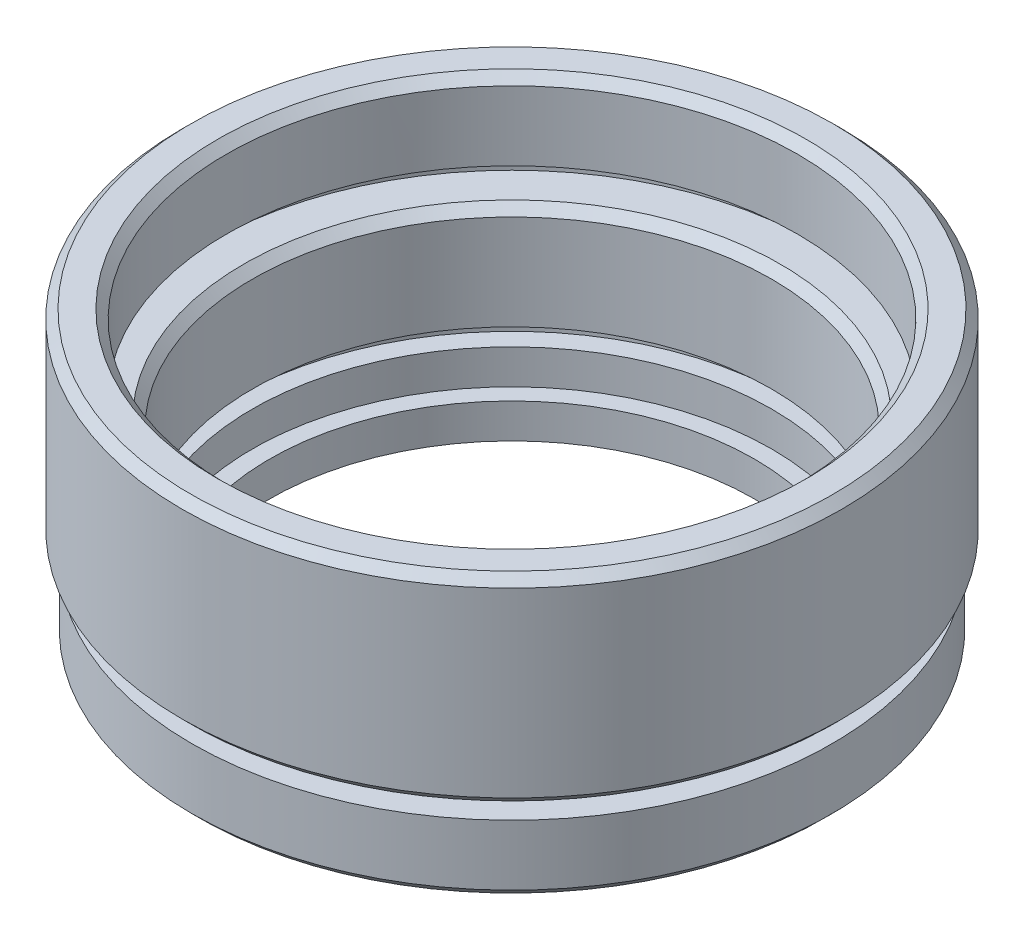
ISO-10303-21;
HEADER;
FILE_DESCRIPTION(('STEP AP214'),'2;1');
FILE_NAME('part.step','',(''),(''),'','','');
FILE_SCHEMA(('AUTOMOTIVE_DESIGN { 1 0 10303 214 1 1 1 1 }'));
ENDSEC;
DATA;
#1=APPLICATION_CONTEXT('core data for automotive mechanical design processes');
#2=APPLICATION_PROTOCOL_DEFINITION('international standard','automotive_design',2000,#1);
#3=PRODUCT_CONTEXT('',#1,'mechanical');
#4=PRODUCT('Part','Part','',(#3));
#5=PRODUCT_RELATED_PRODUCT_CATEGORY('part','',(#4));
#6=PRODUCT_DEFINITION_FORMATION('','',#4);
#7=PRODUCT_DEFINITION_CONTEXT('part definition',#1,'design');
#8=PRODUCT_DEFINITION('design','',#6,#7);
#9=PRODUCT_DEFINITION_SHAPE('','',#8);
#10=(LENGTH_UNIT() NAMED_UNIT(*) SI_UNIT(.MILLI.,.METRE.));
#11=(NAMED_UNIT(*) PLANE_ANGLE_UNIT() SI_UNIT($,.RADIAN.));
#12=(NAMED_UNIT(*) SI_UNIT($,.STERADIAN.) SOLID_ANGLE_UNIT());
#13=UNCERTAINTY_MEASURE_WITH_UNIT(LENGTH_MEASURE(1.E-05),#10,'distance_accuracy_value','');
#14=(GEOMETRIC_REPRESENTATION_CONTEXT(3) GLOBAL_UNCERTAINTY_ASSIGNED_CONTEXT((#13)) GLOBAL_UNIT_ASSIGNED_CONTEXT((#10,
#11,#12)) REPRESENTATION_CONTEXT('',''));
#15=CARTESIAN_POINT('',(0.,0.,0.));
#16=DIRECTION('',(0.,0.,1.));
#17=DIRECTION('',(1.,0.,0.));
#18=AXIS2_PLACEMENT_3D('',#15,#16,#17);
#19=CARTESIAN_POINT('',(16.5,16.5,0.));
#20=DIRECTION('',(0.,1.,0.));
#21=DIRECTION('',(0.,0.,1.));
#22=AXIS2_PLACEMENT_3D('',#19,#20,#21);
#23=PLANE('',#22);
#24=CARTESIAN_POINT('',(0.,16.5,0.));
#25=DIRECTION('',(0.,1.,0.));
#26=DIRECTION('',(0.,0.,1.));
#27=AXIS2_PLACEMENT_3D('',#24,#25,#26);
#28=CIRCLE('',#27,17.);
#29=CARTESIAN_POINT('',(0.,16.5,17.));
#30=VERTEX_POINT('',#29);
#31=EDGE_CURVE('E51',#30,#30,#28,.F.);
#32=ORIENTED_EDGE('',*,*,#31,.T.);
#33=EDGE_LOOP('',(#32));
#34=FACE_BOUND('',#33,.T.);
#35=CARTESIAN_POINT('',(0.,16.5,0.));
#36=DIRECTION('',(0.,-1.,0.));
#37=DIRECTION('',(0.,0.,-1.));
#38=AXIS2_PLACEMENT_3D('',#35,#36,#37);
#39=CIRCLE('',#38,18.55);
#40=CARTESIAN_POINT('',(0.,16.5,-18.55));
#41=VERTEX_POINT('',#40);
#42=EDGE_CURVE('E139',#41,#41,#39,.T.);
#43=ORIENTED_EDGE('',*,*,#42,.F.);
#44=EDGE_LOOP('',(#43));
#45=FACE_BOUND('',#44,.T.);
#46=ADVANCED_FACE('F43',(#34,#45),#23,.T.);
#47=CARTESIAN_POINT('',(0.,0.,0.));
#48=DIRECTION('',(0.,-1.,0.));
#49=DIRECTION('',(0.,0.,-1.));
#50=AXIS2_PLACEMENT_3D('',#47,#48,#49);
#51=CYLINDRICAL_SURFACE('',#50,16.5);
#52=CARTESIAN_POINT('',(0.,16.,0.));
#53=DIRECTION('',(0.,1.,0.));
#54=DIRECTION('',(0.,0.,1.));
#55=AXIS2_PLACEMENT_3D('',#52,#53,#54);
#56=CIRCLE('',#55,16.5);
#57=CARTESIAN_POINT('',(0.,16.,16.5));
#58=VERTEX_POINT('',#57);
#59=EDGE_CURVE('E10',#58,#58,#56,.T.);
#60=ORIENTED_EDGE('',*,*,#59,.T.);
#61=EDGE_LOOP('',(#60));
#62=FACE_BOUND('',#61,.T.);
#63=CARTESIAN_POINT('',(0.,12.,0.));
#64=DIRECTION('',(0.,-1.,0.));
#65=DIRECTION('',(0.,0.,-1.));
#66=AXIS2_PLACEMENT_3D('',#63,#64,#65);
#67=CIRCLE('',#66,16.5);
#68=CARTESIAN_POINT('',(0.,12.,-16.5));
#69=VERTEX_POINT('',#68);
#70=EDGE_CURVE('E70',#69,#69,#67,.T.);
#71=ORIENTED_EDGE('',*,*,#70,.T.);
#72=EDGE_LOOP('',(#71));
#73=FACE_BOUND('',#72,.T.);
#74=ADVANCED_FACE('F148',(#62,#73),#51,.F.);
#75=CARTESIAN_POINT('',(17.6,12.,0.));
#76=DIRECTION('',(0.,-1.,0.));
#77=DIRECTION('',(0.,0.,-1.));
#78=AXIS2_PLACEMENT_3D('',#75,#76,#77);
#79=PLANE('',#78);
#80=CARTESIAN_POINT('',(0.,12.,0.));
#81=DIRECTION('',(0.,-1.,0.));
#82=DIRECTION('',(0.,0.,-1.));
#83=AXIS2_PLACEMENT_3D('',#80,#81,#82);
#84=CIRCLE('',#83,17.6);
#85=CARTESIAN_POINT('',(0.,12.,-17.6));
#86=VERTEX_POINT('',#85);
#87=EDGE_CURVE('E74',#86,#86,#84,.T.);
#88=ORIENTED_EDGE('',*,*,#87,.T.);
#89=EDGE_LOOP('',(#88));
#90=FACE_BOUND('',#89,.T.);
#91=ORIENTED_EDGE('',*,*,#70,.F.);
#92=EDGE_LOOP('',(#91));
#93=FACE_BOUND('',#92,.T.);
#94=ADVANCED_FACE('F153',(#90,#93),#79,.T.);
#95=CARTESIAN_POINT('',(0.,0.,0.));
#96=DIRECTION('',(0.,-1.,0.));
#97=DIRECTION('',(0.,0.,-1.));
#98=AXIS2_PLACEMENT_3D('',#95,#96,#97);
#99=CYLINDRICAL_SURFACE('',#98,17.6);
#100=CARTESIAN_POINT('',(0.,11.,0.));
#101=DIRECTION('',(0.,-1.,0.));
#102=DIRECTION('',(0.,0.,-1.));
#103=AXIS2_PLACEMENT_3D('',#100,#101,#102);
#104=CIRCLE('',#103,17.6);
#105=CARTESIAN_POINT('',(0.,11.,-17.6));
#106=VERTEX_POINT('',#105);
#107=EDGE_CURVE('E78',#106,#106,#104,.T.);
#108=ORIENTED_EDGE('',*,*,#107,.T.);
#109=EDGE_LOOP('',(#108));
#110=FACE_BOUND('',#109,.T.);
#111=ORIENTED_EDGE('',*,*,#87,.F.);
#112=EDGE_LOOP('',(#111));
#113=FACE_BOUND('',#112,.T.);
#114=ADVANCED_FACE('F174',(#110,#113),#99,.F.);
#115=CARTESIAN_POINT('',(15.,11.,0.));
#116=DIRECTION('',(0.,1.,0.));
#117=DIRECTION('',(0.,0.,1.));
#118=AXIS2_PLACEMENT_3D('',#115,#116,#117);
#119=PLANE('',#118);
#120=CARTESIAN_POINT('',(0.,11.,0.));
#121=DIRECTION('',(0.,1.,0.));
#122=DIRECTION('',(0.,0.,1.));
#123=AXIS2_PLACEMENT_3D('',#120,#121,#122);
#124=CIRCLE('',#123,15.5);
#125=CARTESIAN_POINT('',(0.,11.,15.5));
#126=VERTEX_POINT('',#125);
#127=EDGE_CURVE('E64',#126,#126,#124,.F.);
#128=ORIENTED_EDGE('',*,*,#127,.T.);
#129=EDGE_LOOP('',(#128));
#130=FACE_BOUND('',#129,.T.);
#131=ORIENTED_EDGE('',*,*,#107,.F.);
#132=EDGE_LOOP('',(#131));
#133=FACE_BOUND('',#132,.T.);
#134=ADVANCED_FACE('F170',(#130,#133),#119,.T.);
#135=CARTESIAN_POINT('',(0.,0.,0.));
#136=DIRECTION('',(0.,-1.,0.));
#137=DIRECTION('',(0.,0.,-1.));
#138=AXIS2_PLACEMENT_3D('',#135,#136,#137);
#139=CYLINDRICAL_SURFACE('',#138,15.);
#140=CARTESIAN_POINT('',(0.,10.5,0.));
#141=DIRECTION('',(0.,1.,0.));
#142=DIRECTION('',(0.,0.,1.));
#143=AXIS2_PLACEMENT_3D('',#140,#141,#142);
#144=CIRCLE('',#143,15.);
#145=CARTESIAN_POINT('',(0.,10.5,15.));
#146=VERTEX_POINT('',#145);
#147=EDGE_CURVE('E57',#146,#146,#144,.T.);
#148=ORIENTED_EDGE('',*,*,#147,.T.);
#149=EDGE_LOOP('',(#148));
#150=FACE_BOUND('',#149,.T.);
#151=CARTESIAN_POINT('',(0.,5.,0.));
#152=DIRECTION('',(0.,-1.,0.));
#153=DIRECTION('',(0.,0.,-1.));
#154=AXIS2_PLACEMENT_3D('',#151,#152,#153);
#155=CIRCLE('',#154,15.);
#156=CARTESIAN_POINT('',(0.,5.,-15.));
#157=VERTEX_POINT('',#156);
#158=EDGE_CURVE('E82',#157,#157,#155,.T.);
#159=ORIENTED_EDGE('',*,*,#158,.T.);
#160=EDGE_LOOP('',(#159));
#161=FACE_BOUND('',#160,.T.);
#162=ADVANCED_FACE('F173',(#150,#161),#139,.F.);
#163=CARTESIAN_POINT('',(16.1,5.,0.));
#164=DIRECTION('',(0.,-1.,0.));
#165=DIRECTION('',(0.,0.,-1.));
#166=AXIS2_PLACEMENT_3D('',#163,#164,#165);
#167=PLANE('',#166);
#168=CARTESIAN_POINT('',(0.,5.,0.));
#169=DIRECTION('',(0.,-1.,0.));
#170=DIRECTION('',(0.,0.,-1.));
#171=AXIS2_PLACEMENT_3D('',#168,#169,#170);
#172=CIRCLE('',#171,16.1);
#173=CARTESIAN_POINT('',(0.,5.,-16.1));
#174=VERTEX_POINT('',#173);
#175=EDGE_CURVE('E86',#174,#174,#172,.T.);
#176=ORIENTED_EDGE('',*,*,#175,.T.);
#177=EDGE_LOOP('',(#176));
#178=FACE_BOUND('',#177,.T.);
#179=ORIENTED_EDGE('',*,*,#158,.F.);
#180=EDGE_LOOP('',(#179));
#181=FACE_BOUND('',#180,.T.);
#182=ADVANCED_FACE('F192',(#178,#181),#167,.T.);
#183=CARTESIAN_POINT('',(0.,0.,0.));
#184=DIRECTION('',(0.,-1.,0.));
#185=DIRECTION('',(0.,0.,-1.));
#186=AXIS2_PLACEMENT_3D('',#183,#184,#185);
#187=CYLINDRICAL_SURFACE('',#186,16.1);
#188=CARTESIAN_POINT('',(0.,4.,0.));
#189=DIRECTION('',(0.,-1.,0.));
#190=DIRECTION('',(0.,0.,-1.));
#191=AXIS2_PLACEMENT_3D('',#188,#189,#190);
#192=CIRCLE('',#191,16.1);
#193=CARTESIAN_POINT('',(0.,4.,-16.1));
#194=VERTEX_POINT('',#193);
#195=EDGE_CURVE('E90',#194,#194,#192,.T.);
#196=ORIENTED_EDGE('',*,*,#195,.T.);
#197=EDGE_LOOP('',(#196));
#198=FACE_BOUND('',#197,.T.);
#199=ORIENTED_EDGE('',*,*,#175,.F.);
#200=EDGE_LOOP('',(#199));
#201=FACE_BOUND('',#200,.T.);
#202=ADVANCED_FACE('F196',(#198,#201),#187,.F.);
#203=CARTESIAN_POINT('',(15.,4.,0.));
#204=DIRECTION('',(0.,1.,0.));
#205=DIRECTION('',(0.,0.,1.));
#206=AXIS2_PLACEMENT_3D('',#203,#204,#205);
#207=PLANE('',#206);
#208=CARTESIAN_POINT('',(0.,4.,0.));
#209=DIRECTION('',(0.,-1.,0.));
#210=DIRECTION('',(0.,0.,-1.));
#211=AXIS2_PLACEMENT_3D('',#208,#209,#210);
#212=CIRCLE('',#211,15.);
#213=CARTESIAN_POINT('',(0.,4.,-15.));
#214=VERTEX_POINT('',#213);
#215=EDGE_CURVE('E94',#214,#214,#212,.T.);
#216=ORIENTED_EDGE('',*,*,#215,.T.);
#217=EDGE_LOOP('',(#216));
#218=FACE_BOUND('',#217,.T.);
#219=ORIENTED_EDGE('',*,*,#195,.F.);
#220=EDGE_LOOP('',(#219));
#221=FACE_BOUND('',#220,.T.);
#222=ADVANCED_FACE('F200',(#218,#221),#207,.T.);
#223=CARTESIAN_POINT('',(0.,0.,0.));
#224=DIRECTION('',(0.,-1.,0.));
#225=DIRECTION('',(0.,0.,-1.));
#226=AXIS2_PLACEMENT_3D('',#223,#224,#225);
#227=CYLINDRICAL_SURFACE('',#226,15.);
#228=CARTESIAN_POINT('',(0.,2.,0.));
#229=DIRECTION('',(0.,-1.,0.));
#230=DIRECTION('',(0.,0.,-1.));
#231=AXIS2_PLACEMENT_3D('',#228,#229,#230);
#232=CIRCLE('',#231,15.);
#233=CARTESIAN_POINT('',(0.,2.,-15.));
#234=VERTEX_POINT('',#233);
#235=EDGE_CURVE('E98',#234,#234,#232,.T.);
#236=ORIENTED_EDGE('',*,*,#235,.T.);
#237=EDGE_LOOP('',(#236));
#238=FACE_BOUND('',#237,.T.);
#239=ORIENTED_EDGE('',*,*,#215,.F.);
#240=EDGE_LOOP('',(#239));
#241=FACE_BOUND('',#240,.T.);
#242=ADVANCED_FACE('F204',(#238,#241),#227,.F.);
#243=CARTESIAN_POINT('',(14.,2.,0.));
#244=DIRECTION('',(0.,1.,0.));
#245=DIRECTION('',(0.,0.,1.));
#246=AXIS2_PLACEMENT_3D('',#243,#244,#245);
#247=PLANE('',#246);
#248=CARTESIAN_POINT('',(0.,2.,0.));
#249=DIRECTION('',(0.,-1.,0.));
#250=DIRECTION('',(0.,0.,-1.));
#251=AXIS2_PLACEMENT_3D('',#248,#249,#250);
#252=CIRCLE('',#251,14.);
#253=CARTESIAN_POINT('',(0.,2.,-14.));
#254=VERTEX_POINT('',#253);
#255=EDGE_CURVE('E102',#254,#254,#252,.T.);
#256=ORIENTED_EDGE('',*,*,#255,.T.);
#257=EDGE_LOOP('',(#256));
#258=FACE_BOUND('',#257,.T.);
#259=ORIENTED_EDGE('',*,*,#235,.F.);
#260=EDGE_LOOP('',(#259));
#261=FACE_BOUND('',#260,.T.);
#262=ADVANCED_FACE('F208',(#258,#261),#247,.T.);
#263=CARTESIAN_POINT('',(0.,0.,0.));
#264=DIRECTION('',(0.,-1.,0.));
#265=DIRECTION('',(0.,0.,-1.));
#266=AXIS2_PLACEMENT_3D('',#263,#264,#265);
#267=CYLINDRICAL_SURFACE('',#266,14.);
#268=CARTESIAN_POINT('',(0.,0.,0.));
#269=DIRECTION('',(0.,-1.,0.));
#270=DIRECTION('',(0.,0.,-1.));
#271=AXIS2_PLACEMENT_3D('',#268,#269,#270);
#272=CIRCLE('',#271,14.);
#273=CARTESIAN_POINT('',(0.,0.,-14.));
#274=VERTEX_POINT('',#273);
#275=EDGE_CURVE('E105',#274,#274,#272,.T.);
#276=ORIENTED_EDGE('',*,*,#275,.T.);
#277=EDGE_LOOP('',(#276));
#278=FACE_BOUND('',#277,.T.);
#279=ORIENTED_EDGE('',*,*,#255,.F.);
#280=EDGE_LOOP('',(#279));
#281=FACE_BOUND('',#280,.T.);
#282=ADVANCED_FACE('F212',(#278,#281),#267,.F.);
#283=CARTESIAN_POINT('',(14.,0.,0.));
#284=DIRECTION('',(0.,-1.,0.));
#285=DIRECTION('',(0.,0.,-1.));
#286=AXIS2_PLACEMENT_3D('',#283,#284,#285);
#287=PLANE('',#286);
#288=CARTESIAN_POINT('',(0.,0.,0.));
#289=DIRECTION('',(0.,-1.,0.));
#290=DIRECTION('',(0.,0.,-1.));
#291=AXIS2_PLACEMENT_3D('',#288,#289,#290);
#292=CIRCLE('',#291,18.);
#293=CARTESIAN_POINT('',(0.,0.,-18.));
#294=VERTEX_POINT('',#293);
#295=EDGE_CURVE('E109',#294,#294,#292,.T.);
#296=ORIENTED_EDGE('',*,*,#295,.T.);
#297=EDGE_LOOP('',(#296));
#298=FACE_BOUND('',#297,.T.);
#299=ORIENTED_EDGE('',*,*,#275,.F.);
#300=EDGE_LOOP('',(#299));
#301=FACE_BOUND('',#300,.T.);
#302=ADVANCED_FACE('F216',(#298,#301),#287,.T.);
#303=CARTESIAN_POINT('',(0.,0.,0.));
#304=DIRECTION('',(0.,1.,0.));
#305=DIRECTION('',(0.,0.,1.));
#306=AXIS2_PLACEMENT_3D('',#303,#304,#305);
#307=CONICAL_SURFACE('',#306,18.,0.785398163397451);
#308=CARTESIAN_POINT('',(0.,0.499999999999998,0.));
#309=DIRECTION('',(0.,-1.,0.));
#310=DIRECTION('',(0.,0.,-1.));
#311=AXIS2_PLACEMENT_3D('',#308,#309,#310);
#312=CIRCLE('',#311,18.5);
#313=CARTESIAN_POINT('',(0.,0.499999999999998,-18.5));
#314=VERTEX_POINT('',#313);
#315=EDGE_CURVE('E113',#314,#314,#312,.T.);
#316=ORIENTED_EDGE('',*,*,#315,.T.);
#317=EDGE_LOOP('',(#316));
#318=FACE_BOUND('',#317,.T.);
#319=ORIENTED_EDGE('',*,*,#295,.F.);
#320=EDGE_LOOP('',(#319));
#321=FACE_BOUND('',#320,.T.);
#322=ADVANCED_FACE('F220',(#318,#321),#307,.T.);
#323=CARTESIAN_POINT('',(0.,0.,0.));
#324=DIRECTION('',(0.,-1.,0.));
#325=DIRECTION('',(0.,0.,-1.));
#326=AXIS2_PLACEMENT_3D('',#323,#324,#325);
#327=CYLINDRICAL_SURFACE('',#326,18.5);
#328=CARTESIAN_POINT('',(0.,4.,0.));
#329=DIRECTION('',(0.,-1.,0.));
#330=DIRECTION('',(0.,0.,-1.));
#331=AXIS2_PLACEMENT_3D('',#328,#329,#330);
#332=CIRCLE('',#331,18.5);
#333=CARTESIAN_POINT('',(0.,4.,-18.5));
#334=VERTEX_POINT('',#333);
#335=EDGE_CURVE('E117',#334,#334,#332,.T.);
#336=ORIENTED_EDGE('',*,*,#335,.T.);
#337=EDGE_LOOP('',(#336));
#338=FACE_BOUND('',#337,.T.);
#339=ORIENTED_EDGE('',*,*,#315,.F.);
#340=EDGE_LOOP('',(#339));
#341=FACE_BOUND('',#340,.T.);
#342=ADVANCED_FACE('F224',(#338,#341),#327,.T.);
#343=CARTESIAN_POINT('',(18.5,4.,0.));
#344=DIRECTION('',(0.,1.,0.));
#345=DIRECTION('',(0.,0.,1.));
#346=AXIS2_PLACEMENT_3D('',#343,#344,#345);
#347=PLANE('',#346);
#348=CARTESIAN_POINT('',(0.,4.,0.));
#349=DIRECTION('',(0.,-1.,0.));
#350=DIRECTION('',(0.,0.,-1.));
#351=AXIS2_PLACEMENT_3D('',#348,#349,#350);
#352=CIRCLE('',#351,17.);
#353=CARTESIAN_POINT('',(0.,4.,-17.));
#354=VERTEX_POINT('',#353);
#355=EDGE_CURVE('E121',#354,#354,#352,.T.);
#356=ORIENTED_EDGE('',*,*,#355,.T.);
#357=EDGE_LOOP('',(#356));
#358=FACE_BOUND('',#357,.T.);
#359=ORIENTED_EDGE('',*,*,#335,.F.);
#360=EDGE_LOOP('',(#359));
#361=FACE_BOUND('',#360,.T.);
#362=ADVANCED_FACE('F228',(#358,#361),#347,.T.);
#363=CARTESIAN_POINT('',(0.,0.,0.));
#364=DIRECTION('',(0.,-1.,0.));
#365=DIRECTION('',(0.,0.,-1.));
#366=AXIS2_PLACEMENT_3D('',#363,#364,#365);
#367=CYLINDRICAL_SURFACE('',#366,17.);
#368=CARTESIAN_POINT('',(0.,5.,0.));
#369=DIRECTION('',(0.,-1.,0.));
#370=DIRECTION('',(0.,0.,-1.));
#371=AXIS2_PLACEMENT_3D('',#368,#369,#370);
#372=CIRCLE('',#371,17.);
#373=CARTESIAN_POINT('',(0.,5.,-17.));
#374=VERTEX_POINT('',#373);
#375=EDGE_CURVE('E124',#374,#374,#372,.T.);
#376=ORIENTED_EDGE('',*,*,#375,.T.);
#377=EDGE_LOOP('',(#376));
#378=FACE_BOUND('',#377,.T.);
#379=ORIENTED_EDGE('',*,*,#355,.F.);
#380=EDGE_LOOP('',(#379));
#381=FACE_BOUND('',#380,.T.);
#382=ADVANCED_FACE('F232',(#378,#381),#367,.T.);
#383=CARTESIAN_POINT('',(17.,5.,0.));
#384=DIRECTION('',(0.,-1.,0.));
#385=DIRECTION('',(0.,0.,-1.));
#386=AXIS2_PLACEMENT_3D('',#383,#384,#385);
#387=PLANE('',#386);
#388=CARTESIAN_POINT('',(0.,5.,0.));
#389=DIRECTION('',(0.,-1.,0.));
#390=DIRECTION('',(0.,0.,-1.));
#391=AXIS2_PLACEMENT_3D('',#388,#389,#390);
#392=CIRCLE('',#391,18.55);
#393=CARTESIAN_POINT('',(0.,5.,-18.55));
#394=VERTEX_POINT('',#393);
#395=EDGE_CURVE('E128',#394,#394,#392,.T.);
#396=ORIENTED_EDGE('',*,*,#395,.T.);
#397=EDGE_LOOP('',(#396));
#398=FACE_BOUND('',#397,.T.);
#399=ORIENTED_EDGE('',*,*,#375,.F.);
#400=EDGE_LOOP('',(#399));
#401=FACE_BOUND('',#400,.T.);
#402=ADVANCED_FACE('F236',(#398,#401),#387,.T.);
#403=CARTESIAN_POINT('',(0.,5.,0.));
#404=DIRECTION('',(0.,1.,0.));
#405=DIRECTION('',(0.,0.,1.));
#406=AXIS2_PLACEMENT_3D('',#403,#404,#405);
#407=CONICAL_SURFACE('',#406,18.55,0.785398163397451);
#408=CARTESIAN_POINT('',(0.,5.5,0.));
#409=DIRECTION('',(0.,-1.,0.));
#410=DIRECTION('',(0.,0.,-1.));
#411=AXIS2_PLACEMENT_3D('',#408,#409,#410);
#412=CIRCLE('',#411,19.05);
#413=CARTESIAN_POINT('',(0.,5.5,-19.05));
#414=VERTEX_POINT('',#413);
#415=EDGE_CURVE('E131',#414,#414,#412,.T.);
#416=ORIENTED_EDGE('',*,*,#415,.T.);
#417=EDGE_LOOP('',(#416));
#418=FACE_BOUND('',#417,.T.);
#419=ORIENTED_EDGE('',*,*,#395,.F.);
#420=EDGE_LOOP('',(#419));
#421=FACE_BOUND('',#420,.T.);
#422=ADVANCED_FACE('F240',(#418,#421),#407,.T.);
#423=CARTESIAN_POINT('',(0.,0.,0.));
#424=DIRECTION('',(0.,-1.,0.));
#425=DIRECTION('',(0.,0.,-1.));
#426=AXIS2_PLACEMENT_3D('',#423,#424,#425);
#427=CYLINDRICAL_SURFACE('',#426,19.05);
#428=CARTESIAN_POINT('',(0.,16.,0.));
#429=DIRECTION('',(0.,-1.,0.));
#430=DIRECTION('',(0.,0.,-1.));
#431=AXIS2_PLACEMENT_3D('',#428,#429,#430);
#432=CIRCLE('',#431,19.05);
#433=CARTESIAN_POINT('',(0.,16.,-19.05));
#434=VERTEX_POINT('',#433);
#435=EDGE_CURVE('E135',#434,#434,#432,.T.);
#436=ORIENTED_EDGE('',*,*,#435,.T.);
#437=EDGE_LOOP('',(#436));
#438=FACE_BOUND('',#437,.T.);
#439=ORIENTED_EDGE('',*,*,#415,.F.);
#440=EDGE_LOOP('',(#439));
#441=FACE_BOUND('',#440,.T.);
#442=ADVANCED_FACE('F164',(#438,#441),#427,.T.);
#443=CARTESIAN_POINT('',(0.,16.,0.));
#444=DIRECTION('',(0.,-1.,0.));
#445=DIRECTION('',(0.,0.,-1.));
#446=AXIS2_PLACEMENT_3D('',#443,#444,#445);
#447=CONICAL_SURFACE('',#446,19.05,0.785398163397445);
#448=ORIENTED_EDGE('',*,*,#42,.T.);
#449=EDGE_LOOP('',(#448));
#450=FACE_BOUND('',#449,.T.);
#451=ORIENTED_EDGE('',*,*,#435,.F.);
#452=EDGE_LOOP('',(#451));
#453=FACE_BOUND('',#452,.T.);
#454=ADVANCED_FACE('F144',(#450,#453),#447,.T.);
#455=CARTESIAN_POINT('',(0.,11.,0.));
#456=DIRECTION('',(0.,1.,0.));
#457=DIRECTION('',(0.,0.,1.));
#458=AXIS2_PLACEMENT_3D('',#455,#456,#457);
#459=CONICAL_SURFACE('',#458,15.5,0.785398163397443);
#460=ORIENTED_EDGE('',*,*,#147,.F.);
#461=EDGE_LOOP('',(#460));
#462=FACE_BOUND('',#461,.T.);
#463=ORIENTED_EDGE('',*,*,#127,.F.);
#464=EDGE_LOOP('',(#463));
#465=FACE_BOUND('',#464,.T.);
#466=ADVANCED_FACE('F156',(#462,#465),#459,.F.);
#467=CARTESIAN_POINT('',(0.,16.5,0.));
#468=DIRECTION('',(0.,1.,0.));
#469=DIRECTION('',(0.,0.,1.));
#470=AXIS2_PLACEMENT_3D('',#467,#468,#469);
#471=CONICAL_SURFACE('',#470,17.,0.785398163397448);
#472=ORIENTED_EDGE('',*,*,#59,.F.);
#473=EDGE_LOOP('',(#472));
#474=FACE_BOUND('',#473,.T.);
#475=ORIENTED_EDGE('',*,*,#31,.F.);
#476=EDGE_LOOP('',(#475));
#477=FACE_BOUND('',#476,.T.);
#478=ADVANCED_FACE('F45',(#474,#477),#471,.F.);
#479=CLOSED_SHELL('',(#46,#74,#94,#114,#134,#162,#182,#202,#222,#242,#262,#282,#302,#322,#342,
#362,#382,#402,#422,#442,#454,#466,#478));
#480=MANIFOLD_SOLID_BREP('B2',#479);
#481=ADVANCED_BREP_SHAPE_REPRESENTATION('',(#18,#480),#14);
#482=SHAPE_DEFINITION_REPRESENTATION(#9,#481);
ENDSEC;
END-ISO-10303-21;
